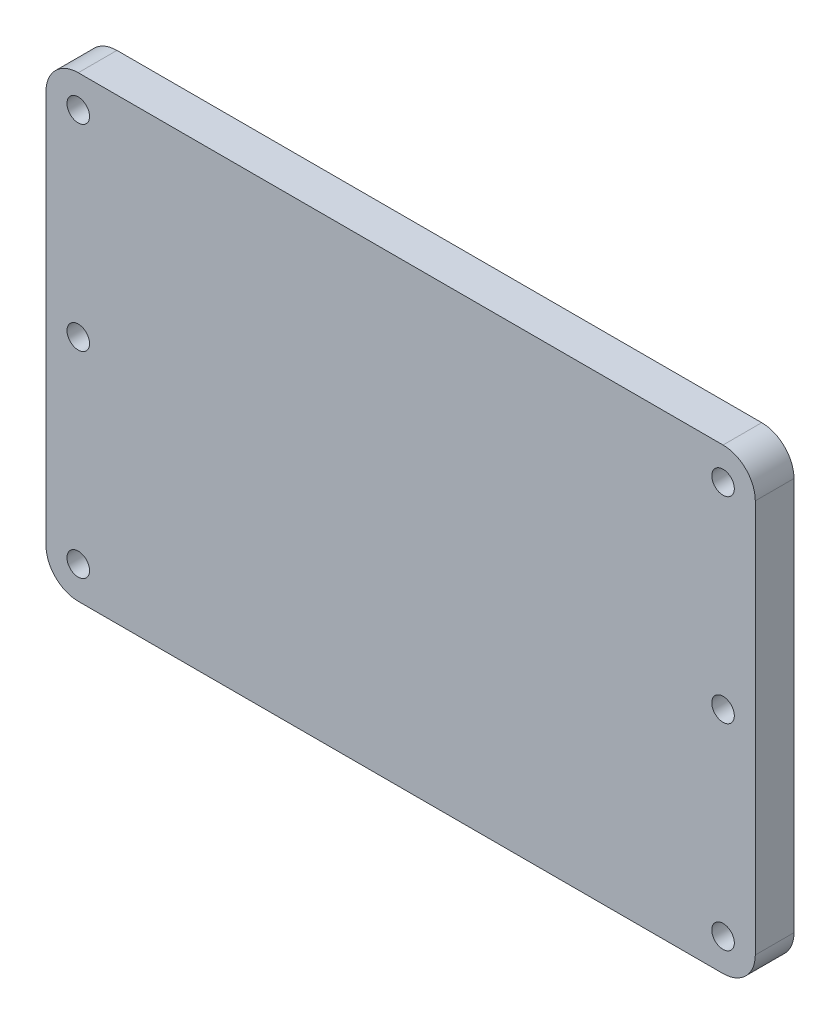
ISO-10303-21;
HEADER;
FILE_DESCRIPTION(('STEP AP214'),'2;1');
FILE_NAME('part.step','',(''),(''),'','','');
FILE_SCHEMA(('AUTOMOTIVE_DESIGN { 1 0 10303 214 1 1 1 1 }'));
ENDSEC;
DATA;
#1=APPLICATION_CONTEXT('core data for automotive mechanical design processes');
#2=APPLICATION_PROTOCOL_DEFINITION('international standard','automotive_design',2000,#1);
#3=PRODUCT_CONTEXT('',#1,'mechanical');
#4=PRODUCT('Part','Part','',(#3));
#5=PRODUCT_RELATED_PRODUCT_CATEGORY('part','',(#4));
#6=PRODUCT_DEFINITION_FORMATION('','',#4);
#7=PRODUCT_DEFINITION_CONTEXT('part definition',#1,'design');
#8=PRODUCT_DEFINITION('design','',#6,#7);
#9=PRODUCT_DEFINITION_SHAPE('','',#8);
#10=(LENGTH_UNIT() NAMED_UNIT(*) SI_UNIT(.MILLI.,.METRE.));
#11=(NAMED_UNIT(*) PLANE_ANGLE_UNIT() SI_UNIT($,.RADIAN.));
#12=(NAMED_UNIT(*) SI_UNIT($,.STERADIAN.) SOLID_ANGLE_UNIT());
#13=UNCERTAINTY_MEASURE_WITH_UNIT(LENGTH_MEASURE(1.E-05),#10,'distance_accuracy_value','');
#14=(GEOMETRIC_REPRESENTATION_CONTEXT(3) GLOBAL_UNCERTAINTY_ASSIGNED_CONTEXT((#13)) GLOBAL_UNIT_ASSIGNED_CONTEXT((#10,
#11,#12)) REPRESENTATION_CONTEXT('',''));
#15=CARTESIAN_POINT('',(0.,0.,0.));
#16=DIRECTION('',(0.,0.,1.));
#17=DIRECTION('',(1.,0.,0.));
#18=AXIS2_PLACEMENT_3D('',#15,#16,#17);
#19=CARTESIAN_POINT('',(0.,0.,6.));
#20=DIRECTION('',(0.,0.,1.));
#21=DIRECTION('',(1.,0.,0.));
#22=AXIS2_PLACEMENT_3D('',#19,#20,#21);
#23=PLANE('',#22);
#24=CARTESIAN_POINT('',(-50.,0.,6.));
#25=DIRECTION('',(0.,0.,1.));
#26=DIRECTION('',(1.,0.,0.));
#27=AXIS2_PLACEMENT_3D('',#24,#25,#26);
#28=CIRCLE('',#27,1.75);
#29=CARTESIAN_POINT('',(-48.25,0.,6.));
#30=VERTEX_POINT('',#29);
#31=EDGE_CURVE('E202',#30,#30,#28,.T.);
#32=ORIENTED_EDGE('',*,*,#31,.F.);
#33=EDGE_LOOP('',(#32));
#34=FACE_BOUND('',#33,.T.);
#35=CARTESIAN_POINT('',(50.,-30.5,6.));
#36=DIRECTION('',(0.,0.,1.));
#37=DIRECTION('',(1.,0.,0.));
#38=AXIS2_PLACEMENT_3D('',#35,#36,#37);
#39=CIRCLE('',#38,1.75);
#40=CARTESIAN_POINT('',(51.75,-30.5,6.));
#41=VERTEX_POINT('',#40);
#42=EDGE_CURVE('E190',#41,#41,#39,.T.);
#43=ORIENTED_EDGE('',*,*,#42,.F.);
#44=EDGE_LOOP('',(#43));
#45=FACE_BOUND('',#44,.T.);
#46=CARTESIAN_POINT('',(-50.,30.5,6.));
#47=DIRECTION('',(0.,0.,1.));
#48=DIRECTION('',(1.,0.,0.));
#49=AXIS2_PLACEMENT_3D('',#46,#47,#48);
#50=CIRCLE('',#49,1.75);
#51=CARTESIAN_POINT('',(-48.25,30.5,6.));
#52=VERTEX_POINT('',#51);
#53=EDGE_CURVE('E136',#52,#52,#50,.T.);
#54=ORIENTED_EDGE('',*,*,#53,.F.);
#55=EDGE_LOOP('',(#54));
#56=FACE_BOUND('',#55,.T.);
#57=DIRECTION('',(0.,-1.,0.));
#58=VECTOR('',#57,1.);
#59=CARTESIAN_POINT('',(-55.,35.5,6.));
#60=LINE('',#59,#58);
#61=CARTESIAN_POINT('',(-55.,30.5,6.));
#62=VERTEX_POINT('',#61);
#63=CARTESIAN_POINT('',(-55.,-30.5,6.));
#64=VERTEX_POINT('',#63);
#65=EDGE_CURVE('E141',#62,#64,#60,.T.);
#66=ORIENTED_EDGE('',*,*,#65,.T.);
#67=CARTESIAN_POINT('',(-50.,-30.5,6.));
#68=DIRECTION('',(0.,0.,1.));
#69=DIRECTION('',(1.,0.,0.));
#70=AXIS2_PLACEMENT_3D('',#67,#68,#69);
#71=CIRCLE('',#70,5.);
#72=CARTESIAN_POINT('',(-50.,-35.5,6.));
#73=VERTEX_POINT('',#72);
#74=EDGE_CURVE('E156',#64,#73,#71,.T.);
#75=ORIENTED_EDGE('',*,*,#74,.T.);
#76=DIRECTION('',(1.,0.,0.));
#77=VECTOR('',#76,1.);
#78=CARTESIAN_POINT('',(-55.,-35.5,6.));
#79=LINE('',#78,#77);
#80=CARTESIAN_POINT('',(50.,-35.5,6.));
#81=VERTEX_POINT('',#80);
#82=EDGE_CURVE('E123',#73,#81,#79,.T.);
#83=ORIENTED_EDGE('',*,*,#82,.T.);
#84=CARTESIAN_POINT('',(50.,-30.5,6.));
#85=DIRECTION('',(0.,0.,1.));
#86=DIRECTION('',(1.,0.,0.));
#87=AXIS2_PLACEMENT_3D('',#84,#85,#86);
#88=CIRCLE('',#87,5.);
#89=CARTESIAN_POINT('',(55.,-30.5,6.));
#90=VERTEX_POINT('',#89);
#91=EDGE_CURVE('E154',#81,#90,#88,.T.);
#92=ORIENTED_EDGE('',*,*,#91,.T.);
#93=DIRECTION('',(0.,1.,0.));
#94=VECTOR('',#93,1.);
#95=CARTESIAN_POINT('',(55.,35.5,6.));
#96=LINE('',#95,#94);
#97=CARTESIAN_POINT('',(55.,30.5,6.));
#98=VERTEX_POINT('',#97);
#99=EDGE_CURVE('E167',#90,#98,#96,.T.);
#100=ORIENTED_EDGE('',*,*,#99,.T.);
#101=CARTESIAN_POINT('',(50.,30.5,6.));
#102=DIRECTION('',(0.,0.,1.));
#103=DIRECTION('',(1.,0.,0.));
#104=AXIS2_PLACEMENT_3D('',#101,#102,#103);
#105=CIRCLE('',#104,5.);
#106=CARTESIAN_POINT('',(50.,35.5,6.));
#107=VERTEX_POINT('',#106);
#108=EDGE_CURVE('E58',#98,#107,#105,.T.);
#109=ORIENTED_EDGE('',*,*,#108,.T.);
#110=DIRECTION('',(-1.,0.,0.));
#111=VECTOR('',#110,1.);
#112=CARTESIAN_POINT('',(-55.,35.5,6.));
#113=LINE('',#112,#111);
#114=CARTESIAN_POINT('',(-50.,35.5,6.));
#115=VERTEX_POINT('',#114);
#116=EDGE_CURVE('E142',#107,#115,#113,.T.);
#117=ORIENTED_EDGE('',*,*,#116,.T.);
#118=CARTESIAN_POINT('',(-50.,30.5,6.));
#119=DIRECTION('',(0.,0.,1.));
#120=DIRECTION('',(1.,0.,0.));
#121=AXIS2_PLACEMENT_3D('',#118,#119,#120);
#122=CIRCLE('',#121,5.);
#123=EDGE_CURVE('E151',#115,#62,#122,.T.);
#124=ORIENTED_EDGE('',*,*,#123,.T.);
#125=EDGE_LOOP('',(#66,#75,#83,#92,#100,#109,#117,#124));
#126=FACE_BOUND('',#125,.T.);
#127=CARTESIAN_POINT('',(50.,30.5,6.));
#128=DIRECTION('',(0.,0.,1.));
#129=DIRECTION('',(-1.,0.,0.));
#130=AXIS2_PLACEMENT_3D('',#127,#128,#129);
#131=CIRCLE('',#130,1.75);
#132=CARTESIAN_POINT('',(48.25,30.5,6.));
#133=VERTEX_POINT('',#132);
#134=EDGE_CURVE('E184',#133,#133,#131,.T.);
#135=ORIENTED_EDGE('',*,*,#134,.F.);
#136=EDGE_LOOP('',(#135));
#137=FACE_BOUND('',#136,.T.);
#138=CARTESIAN_POINT('',(-50.,-30.5,6.));
#139=DIRECTION('',(0.,0.,1.));
#140=DIRECTION('',(-1.,0.,0.));
#141=AXIS2_PLACEMENT_3D('',#138,#139,#140);
#142=CIRCLE('',#141,1.75);
#143=CARTESIAN_POINT('',(-51.75,-30.5,6.));
#144=VERTEX_POINT('',#143);
#145=EDGE_CURVE('E196',#144,#144,#142,.T.);
#146=ORIENTED_EDGE('',*,*,#145,.F.);
#147=EDGE_LOOP('',(#146));
#148=FACE_BOUND('',#147,.T.);
#149=CARTESIAN_POINT('',(50.,0.,6.));
#150=DIRECTION('',(0.,0.,1.));
#151=DIRECTION('',(-1.,0.,0.));
#152=AXIS2_PLACEMENT_3D('',#149,#150,#151);
#153=CIRCLE('',#152,1.75);
#154=CARTESIAN_POINT('',(48.25,0.,6.));
#155=VERTEX_POINT('',#154);
#156=EDGE_CURVE('E208',#155,#155,#153,.T.);
#157=ORIENTED_EDGE('',*,*,#156,.F.);
#158=EDGE_LOOP('',(#157));
#159=FACE_BOUND('',#158,.T.);
#160=ADVANCED_FACE('F37',(#34,#45,#56,#126,#137,#148,#159),#23,.T.);
#161=CARTESIAN_POINT('',(0.,0.,0.));
#162=DIRECTION('',(0.,0.,1.));
#163=DIRECTION('',(1.,0.,0.));
#164=AXIS2_PLACEMENT_3D('',#161,#162,#163);
#165=PLANE('',#164);
#166=DIRECTION('',(1.,0.,0.));
#167=VECTOR('',#166,1.);
#168=CARTESIAN_POINT('',(-55.,-35.5,0.));
#169=LINE('',#168,#167);
#170=CARTESIAN_POINT('',(-50.,-35.5,0.));
#171=VERTEX_POINT('',#170);
#172=CARTESIAN_POINT('',(50.,-35.5,0.));
#173=VERTEX_POINT('',#172);
#174=EDGE_CURVE('E120',#171,#173,#169,.T.);
#175=ORIENTED_EDGE('',*,*,#174,.F.);
#176=CARTESIAN_POINT('',(-50.,-30.5,0.));
#177=DIRECTION('',(0.,0.,1.));
#178=DIRECTION('',(1.,0.,0.));
#179=AXIS2_PLACEMENT_3D('',#176,#177,#178);
#180=CIRCLE('',#179,5.);
#181=CARTESIAN_POINT('',(-55.,-30.5,0.));
#182=VERTEX_POINT('',#181);
#183=EDGE_CURVE('E103',#171,#182,#180,.F.);
#184=ORIENTED_EDGE('',*,*,#183,.T.);
#185=DIRECTION('',(0.,-1.,0.));
#186=VECTOR('',#185,1.);
#187=CARTESIAN_POINT('',(-55.,35.5,0.));
#188=LINE('',#187,#186);
#189=CARTESIAN_POINT('',(-55.,30.5,0.));
#190=VERTEX_POINT('',#189);
#191=EDGE_CURVE('E131',#190,#182,#188,.T.);
#192=ORIENTED_EDGE('',*,*,#191,.F.);
#193=CARTESIAN_POINT('',(-50.,30.5,0.));
#194=DIRECTION('',(0.,0.,1.));
#195=DIRECTION('',(1.,0.,0.));
#196=AXIS2_PLACEMENT_3D('',#193,#194,#195);
#197=CIRCLE('',#196,5.);
#198=CARTESIAN_POINT('',(-50.,35.5,0.));
#199=VERTEX_POINT('',#198);
#200=EDGE_CURVE('E124',#190,#199,#197,.F.);
#201=ORIENTED_EDGE('',*,*,#200,.T.);
#202=DIRECTION('',(-1.,0.,0.));
#203=VECTOR('',#202,1.);
#204=CARTESIAN_POINT('',(-55.,35.5,0.));
#205=LINE('',#204,#203);
#206=CARTESIAN_POINT('',(50.,35.5,0.));
#207=VERTEX_POINT('',#206);
#208=EDGE_CURVE('E134',#207,#199,#205,.T.);
#209=ORIENTED_EDGE('',*,*,#208,.F.);
#210=CARTESIAN_POINT('',(50.,30.5,0.));
#211=DIRECTION('',(0.,0.,1.));
#212=DIRECTION('',(1.,0.,0.));
#213=AXIS2_PLACEMENT_3D('',#210,#211,#212);
#214=CIRCLE('',#213,5.);
#215=CARTESIAN_POINT('',(55.,30.5,0.));
#216=VERTEX_POINT('',#215);
#217=EDGE_CURVE('E145',#207,#216,#214,.F.);
#218=ORIENTED_EDGE('',*,*,#217,.T.);
#219=DIRECTION('',(0.,1.,0.));
#220=VECTOR('',#219,1.);
#221=CARTESIAN_POINT('',(55.,35.5,0.));
#222=LINE('',#221,#220);
#223=CARTESIAN_POINT('',(55.,-30.5,0.));
#224=VERTEX_POINT('',#223);
#225=EDGE_CURVE('E130',#224,#216,#222,.T.);
#226=ORIENTED_EDGE('',*,*,#225,.F.);
#227=CARTESIAN_POINT('',(50.,-30.5,0.));
#228=DIRECTION('',(0.,0.,1.));
#229=DIRECTION('',(1.,0.,0.));
#230=AXIS2_PLACEMENT_3D('',#227,#228,#229);
#231=CIRCLE('',#230,5.);
#232=EDGE_CURVE('E114',#224,#173,#231,.F.);
#233=ORIENTED_EDGE('',*,*,#232,.T.);
#234=EDGE_LOOP('',(#175,#184,#192,#201,#209,#218,#226,#233));
#235=FACE_BOUND('',#234,.T.);
#236=CARTESIAN_POINT('',(-50.,30.5,0.));
#237=DIRECTION('',(0.,0.,1.));
#238=DIRECTION('',(1.,0.,0.));
#239=AXIS2_PLACEMENT_3D('',#236,#237,#238);
#240=CIRCLE('',#239,1.75);
#241=CARTESIAN_POINT('',(-48.25,30.5,0.));
#242=VERTEX_POINT('',#241);
#243=EDGE_CURVE('E181',#242,#242,#240,.T.);
#244=ORIENTED_EDGE('',*,*,#243,.T.);
#245=EDGE_LOOP('',(#244));
#246=FACE_BOUND('',#245,.T.);
#247=CARTESIAN_POINT('',(50.,30.5,0.));
#248=DIRECTION('',(0.,0.,1.));
#249=DIRECTION('',(-1.,0.,0.));
#250=AXIS2_PLACEMENT_3D('',#247,#248,#249);
#251=CIRCLE('',#250,1.75);
#252=CARTESIAN_POINT('',(48.25,30.5,0.));
#253=VERTEX_POINT('',#252);
#254=EDGE_CURVE('E187',#253,#253,#251,.T.);
#255=ORIENTED_EDGE('',*,*,#254,.T.);
#256=EDGE_LOOP('',(#255));
#257=FACE_BOUND('',#256,.T.);
#258=CARTESIAN_POINT('',(50.,-30.5,0.));
#259=DIRECTION('',(0.,0.,1.));
#260=DIRECTION('',(1.,0.,0.));
#261=AXIS2_PLACEMENT_3D('',#258,#259,#260);
#262=CIRCLE('',#261,1.75);
#263=CARTESIAN_POINT('',(51.75,-30.5,0.));
#264=VERTEX_POINT('',#263);
#265=EDGE_CURVE('E193',#264,#264,#262,.T.);
#266=ORIENTED_EDGE('',*,*,#265,.T.);
#267=EDGE_LOOP('',(#266));
#268=FACE_BOUND('',#267,.T.);
#269=CARTESIAN_POINT('',(-50.,-30.5,0.));
#270=DIRECTION('',(0.,0.,1.));
#271=DIRECTION('',(-1.,0.,0.));
#272=AXIS2_PLACEMENT_3D('',#269,#270,#271);
#273=CIRCLE('',#272,1.75);
#274=CARTESIAN_POINT('',(-51.75,-30.5,0.));
#275=VERTEX_POINT('',#274);
#276=EDGE_CURVE('E199',#275,#275,#273,.T.);
#277=ORIENTED_EDGE('',*,*,#276,.T.);
#278=EDGE_LOOP('',(#277));
#279=FACE_BOUND('',#278,.T.);
#280=CARTESIAN_POINT('',(-50.,0.,0.));
#281=DIRECTION('',(0.,0.,1.));
#282=DIRECTION('',(1.,0.,0.));
#283=AXIS2_PLACEMENT_3D('',#280,#281,#282);
#284=CIRCLE('',#283,1.75);
#285=CARTESIAN_POINT('',(-48.25,0.,0.));
#286=VERTEX_POINT('',#285);
#287=EDGE_CURVE('E205',#286,#286,#284,.T.);
#288=ORIENTED_EDGE('',*,*,#287,.T.);
#289=EDGE_LOOP('',(#288));
#290=FACE_BOUND('',#289,.T.);
#291=CARTESIAN_POINT('',(50.,0.,0.));
#292=DIRECTION('',(0.,0.,1.));
#293=DIRECTION('',(-1.,0.,0.));
#294=AXIS2_PLACEMENT_3D('',#291,#292,#293);
#295=CIRCLE('',#294,1.75);
#296=CARTESIAN_POINT('',(48.25,0.,0.));
#297=VERTEX_POINT('',#296);
#298=EDGE_CURVE('E211',#297,#297,#295,.T.);
#299=ORIENTED_EDGE('',*,*,#298,.T.);
#300=EDGE_LOOP('',(#299));
#301=FACE_BOUND('',#300,.T.);
#302=ADVANCED_FACE('F127',(#235,#246,#257,#268,#279,#290,#301),#165,.F.);
#303=CARTESIAN_POINT('',(-55.,35.5,6.));
#304=DIRECTION('',(1.,0.,0.));
#305=DIRECTION('',(0.,1.,0.));
#306=AXIS2_PLACEMENT_3D('',#303,#304,#305);
#307=PLANE('',#306);
#308=ORIENTED_EDGE('',*,*,#191,.T.);
#309=DIRECTION('',(0.,0.,-1.));
#310=VECTOR('',#309,1.);
#311=CARTESIAN_POINT('',(-55.,-30.5,6.));
#312=LINE('',#311,#310);
#313=EDGE_CURVE('E108',#182,#64,#312,.F.);
#314=ORIENTED_EDGE('',*,*,#313,.T.);
#315=ORIENTED_EDGE('',*,*,#65,.F.);
#316=DIRECTION('',(0.,0.,-1.));
#317=VECTOR('',#316,1.);
#318=CARTESIAN_POINT('',(-55.,30.5,6.));
#319=LINE('',#318,#317);
#320=EDGE_CURVE('E113',#62,#190,#319,.T.);
#321=ORIENTED_EDGE('',*,*,#320,.T.);
#322=EDGE_LOOP('',(#308,#314,#315,#321));
#323=FACE_BOUND('',#322,.T.);
#324=ADVANCED_FACE('F226',(#323),#307,.F.);
#325=CARTESIAN_POINT('',(-55.,-35.5,6.));
#326=DIRECTION('',(0.,1.,0.));
#327=DIRECTION('',(-1.,0.,0.));
#328=AXIS2_PLACEMENT_3D('',#325,#326,#327);
#329=PLANE('',#328);
#330=ORIENTED_EDGE('',*,*,#82,.F.);
#331=DIRECTION('',(0.,0.,-1.));
#332=VECTOR('',#331,1.);
#333=CARTESIAN_POINT('',(-50.,-35.5,6.));
#334=LINE('',#333,#332);
#335=EDGE_CURVE('E107',#73,#171,#334,.T.);
#336=ORIENTED_EDGE('',*,*,#335,.T.);
#337=ORIENTED_EDGE('',*,*,#174,.T.);
#338=DIRECTION('',(0.,0.,-1.));
#339=VECTOR('',#338,1.);
#340=CARTESIAN_POINT('',(50.,-35.5,6.));
#341=LINE('',#340,#339);
#342=EDGE_CURVE('E125',#173,#81,#341,.F.);
#343=ORIENTED_EDGE('',*,*,#342,.T.);
#344=EDGE_LOOP('',(#330,#336,#337,#343));
#345=FACE_BOUND('',#344,.T.);
#346=ADVANCED_FACE('F119',(#345),#329,.F.);
#347=CARTESIAN_POINT('',(55.,35.5,6.));
#348=DIRECTION('',(-1.,0.,0.));
#349=DIRECTION('',(0.,0.,1.));
#350=AXIS2_PLACEMENT_3D('',#347,#348,#349);
#351=PLANE('',#350);
#352=ORIENTED_EDGE('',*,*,#99,.F.);
#353=DIRECTION('',(0.,0.,-1.));
#354=VECTOR('',#353,1.);
#355=CARTESIAN_POINT('',(55.,-30.5,6.));
#356=LINE('',#355,#354);
#357=EDGE_CURVE('E160',#90,#224,#356,.T.);
#358=ORIENTED_EDGE('',*,*,#357,.T.);
#359=ORIENTED_EDGE('',*,*,#225,.T.);
#360=DIRECTION('',(0.,0.,-1.));
#361=VECTOR('',#360,1.);
#362=CARTESIAN_POINT('',(55.,30.5,6.));
#363=LINE('',#362,#361);
#364=EDGE_CURVE('E158',#216,#98,#363,.F.);
#365=ORIENTED_EDGE('',*,*,#364,.T.);
#366=EDGE_LOOP('',(#352,#358,#359,#365));
#367=FACE_BOUND('',#366,.T.);
#368=ADVANCED_FACE('F165',(#367),#351,.F.);
#369=CARTESIAN_POINT('',(-55.,35.5,6.));
#370=DIRECTION('',(0.,-1.,0.));
#371=DIRECTION('',(1.,0.,0.));
#372=AXIS2_PLACEMENT_3D('',#369,#370,#371);
#373=PLANE('',#372);
#374=ORIENTED_EDGE('',*,*,#116,.F.);
#375=DIRECTION('',(0.,0.,-1.));
#376=VECTOR('',#375,1.);
#377=CARTESIAN_POINT('',(50.,35.5,6.));
#378=LINE('',#377,#376);
#379=EDGE_CURVE('E11',#107,#207,#378,.T.);
#380=ORIENTED_EDGE('',*,*,#379,.T.);
#381=ORIENTED_EDGE('',*,*,#208,.T.);
#382=DIRECTION('',(0.,0.,-1.));
#383=VECTOR('',#382,1.);
#384=CARTESIAN_POINT('',(-50.,35.5,6.));
#385=LINE('',#384,#383);
#386=EDGE_CURVE('E45',#199,#115,#385,.F.);
#387=ORIENTED_EDGE('',*,*,#386,.T.);
#388=EDGE_LOOP('',(#374,#380,#381,#387));
#389=FACE_BOUND('',#388,.T.);
#390=ADVANCED_FACE('F174',(#389),#373,.F.);
#391=CARTESIAN_POINT('',(-50.,30.5,6.));
#392=DIRECTION('',(0.,0.,-1.));
#393=DIRECTION('',(-1.,0.,0.));
#394=AXIS2_PLACEMENT_3D('',#391,#392,#393);
#395=CYLINDRICAL_SURFACE('',#394,1.75);
#396=ORIENTED_EDGE('',*,*,#53,.T.);
#397=EDGE_LOOP('',(#396));
#398=FACE_BOUND('',#397,.T.);
#399=ORIENTED_EDGE('',*,*,#243,.F.);
#400=EDGE_LOOP('',(#399));
#401=FACE_BOUND('',#400,.T.);
#402=ADVANCED_FACE('F231',(#398,#401),#395,.F.);
#403=CARTESIAN_POINT('',(50.,30.5,6.));
#404=DIRECTION('',(0.,0.,-1.));
#405=DIRECTION('',(-1.,0.,0.));
#406=AXIS2_PLACEMENT_3D('',#403,#404,#405);
#407=CYLINDRICAL_SURFACE('',#406,1.75);
#408=ORIENTED_EDGE('',*,*,#134,.T.);
#409=EDGE_LOOP('',(#408));
#410=FACE_BOUND('',#409,.T.);
#411=ORIENTED_EDGE('',*,*,#254,.F.);
#412=EDGE_LOOP('',(#411));
#413=FACE_BOUND('',#412,.T.);
#414=ADVANCED_FACE('F282',(#410,#413),#407,.F.);
#415=CARTESIAN_POINT('',(50.,-30.5,6.));
#416=DIRECTION('',(0.,0.,-1.));
#417=DIRECTION('',(-1.,0.,0.));
#418=AXIS2_PLACEMENT_3D('',#415,#416,#417);
#419=CYLINDRICAL_SURFACE('',#418,1.75);
#420=ORIENTED_EDGE('',*,*,#42,.T.);
#421=EDGE_LOOP('',(#420));
#422=FACE_BOUND('',#421,.T.);
#423=ORIENTED_EDGE('',*,*,#265,.F.);
#424=EDGE_LOOP('',(#423));
#425=FACE_BOUND('',#424,.T.);
#426=ADVANCED_FACE('F265',(#422,#425),#419,.F.);
#427=CARTESIAN_POINT('',(-50.,-30.5,6.));
#428=DIRECTION('',(0.,0.,-1.));
#429=DIRECTION('',(-1.,0.,0.));
#430=AXIS2_PLACEMENT_3D('',#427,#428,#429);
#431=CYLINDRICAL_SURFACE('',#430,1.75);
#432=ORIENTED_EDGE('',*,*,#145,.T.);
#433=EDGE_LOOP('',(#432));
#434=FACE_BOUND('',#433,.T.);
#435=ORIENTED_EDGE('',*,*,#276,.F.);
#436=EDGE_LOOP('',(#435));
#437=FACE_BOUND('',#436,.T.);
#438=ADVANCED_FACE('F261',(#434,#437),#431,.F.);
#439=CARTESIAN_POINT('',(-50.,0.,6.));
#440=DIRECTION('',(0.,0.,-1.));
#441=DIRECTION('',(-1.,0.,0.));
#442=AXIS2_PLACEMENT_3D('',#439,#440,#441);
#443=CYLINDRICAL_SURFACE('',#442,1.75);
#444=ORIENTED_EDGE('',*,*,#31,.T.);
#445=EDGE_LOOP('',(#444));
#446=FACE_BOUND('',#445,.T.);
#447=ORIENTED_EDGE('',*,*,#287,.F.);
#448=EDGE_LOOP('',(#447));
#449=FACE_BOUND('',#448,.T.);
#450=ADVANCED_FACE('F264',(#446,#449),#443,.F.);
#451=CARTESIAN_POINT('',(50.,0.,6.));
#452=DIRECTION('',(0.,0.,-1.));
#453=DIRECTION('',(-1.,0.,0.));
#454=AXIS2_PLACEMENT_3D('',#451,#452,#453);
#455=CYLINDRICAL_SURFACE('',#454,1.75);
#456=ORIENTED_EDGE('',*,*,#156,.T.);
#457=EDGE_LOOP('',(#456));
#458=FACE_BOUND('',#457,.T.);
#459=ORIENTED_EDGE('',*,*,#298,.F.);
#460=EDGE_LOOP('',(#459));
#461=FACE_BOUND('',#460,.T.);
#462=ADVANCED_FACE('F217',(#458,#461),#455,.F.);
#463=CARTESIAN_POINT('',(-50.,-30.5,6.));
#464=DIRECTION('',(0.,0.,-1.));
#465=DIRECTION('',(-1.,0.,0.));
#466=AXIS2_PLACEMENT_3D('',#463,#464,#465);
#467=CYLINDRICAL_SURFACE('',#466,5.);
#468=ORIENTED_EDGE('',*,*,#74,.F.);
#469=ORIENTED_EDGE('',*,*,#313,.F.);
#470=ORIENTED_EDGE('',*,*,#183,.F.);
#471=ORIENTED_EDGE('',*,*,#335,.F.);
#472=EDGE_LOOP('',(#468,#469,#470,#471));
#473=FACE_BOUND('',#472,.T.);
#474=ADVANCED_FACE('F106',(#473),#467,.T.);
#475=CARTESIAN_POINT('',(50.,-30.5,6.));
#476=DIRECTION('',(0.,0.,-1.));
#477=DIRECTION('',(-1.,0.,0.));
#478=AXIS2_PLACEMENT_3D('',#475,#476,#477);
#479=CYLINDRICAL_SURFACE('',#478,5.);
#480=ORIENTED_EDGE('',*,*,#91,.F.);
#481=ORIENTED_EDGE('',*,*,#342,.F.);
#482=ORIENTED_EDGE('',*,*,#232,.F.);
#483=ORIENTED_EDGE('',*,*,#357,.F.);
#484=EDGE_LOOP('',(#480,#481,#482,#483));
#485=FACE_BOUND('',#484,.T.);
#486=ADVANCED_FACE('F245',(#485),#479,.T.);
#487=CARTESIAN_POINT('',(50.,30.5,6.));
#488=DIRECTION('',(0.,0.,-1.));
#489=DIRECTION('',(-1.,0.,0.));
#490=AXIS2_PLACEMENT_3D('',#487,#488,#489);
#491=CYLINDRICAL_SURFACE('',#490,5.);
#492=ORIENTED_EDGE('',*,*,#108,.F.);
#493=ORIENTED_EDGE('',*,*,#364,.F.);
#494=ORIENTED_EDGE('',*,*,#217,.F.);
#495=ORIENTED_EDGE('',*,*,#379,.F.);
#496=EDGE_LOOP('',(#492,#493,#494,#495));
#497=FACE_BOUND('',#496,.T.);
#498=ADVANCED_FACE('F173',(#497),#491,.T.);
#499=CARTESIAN_POINT('',(-50.,30.5,6.));
#500=DIRECTION('',(0.,0.,-1.));
#501=DIRECTION('',(-1.,0.,0.));
#502=AXIS2_PLACEMENT_3D('',#499,#500,#501);
#503=CYLINDRICAL_SURFACE('',#502,5.);
#504=ORIENTED_EDGE('',*,*,#123,.F.);
#505=ORIENTED_EDGE('',*,*,#386,.F.);
#506=ORIENTED_EDGE('',*,*,#200,.F.);
#507=ORIENTED_EDGE('',*,*,#320,.F.);
#508=EDGE_LOOP('',(#504,#505,#506,#507));
#509=FACE_BOUND('',#508,.T.);
#510=ADVANCED_FACE('F39',(#509),#503,.T.);
#511=CLOSED_SHELL('',(#160,#302,#324,#346,#368,#390,#402,#414,#426,#438,#450,#462,#474,#486,
#498,#510));
#512=MANIFOLD_SOLID_BREP('B2',#511);
#513=ADVANCED_BREP_SHAPE_REPRESENTATION('',(#18,#512),#14);
#514=SHAPE_DEFINITION_REPRESENTATION(#9,#513);
ENDSEC;
END-ISO-10303-21;
